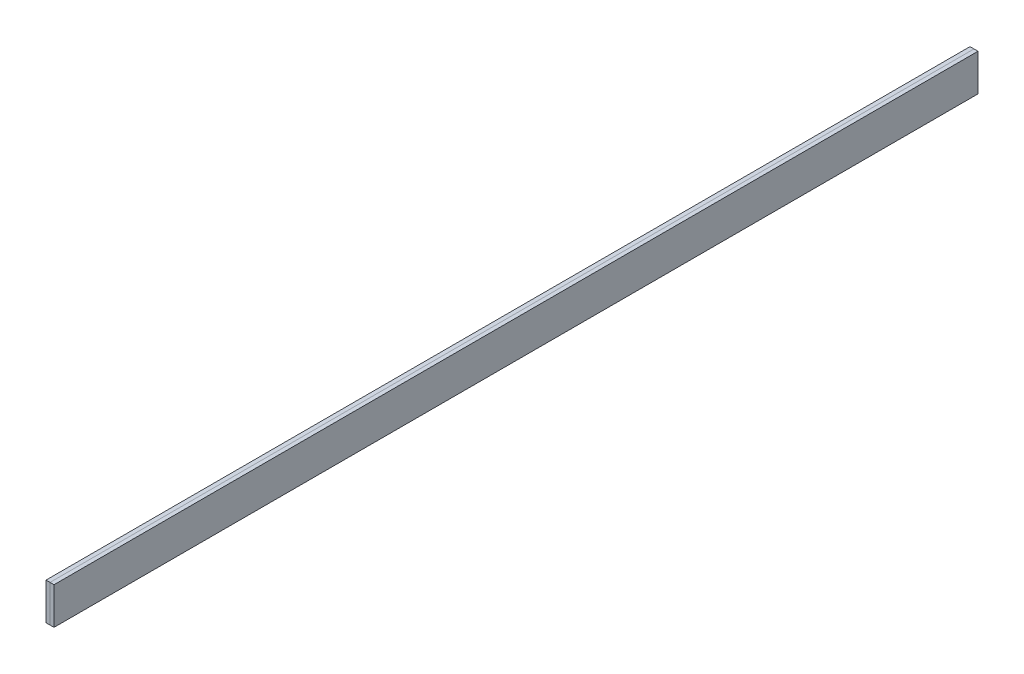
ISO-10303-21;
HEADER;
FILE_DESCRIPTION(('STEP AP214'),'2;1');
FILE_NAME('part.step','',(''),(''),'','','');
FILE_SCHEMA(('AUTOMOTIVE_DESIGN { 1 0 10303 214 1 1 1 1 }'));
ENDSEC;
DATA;
#1=APPLICATION_CONTEXT('core data for automotive mechanical design processes');
#2=APPLICATION_PROTOCOL_DEFINITION('international standard','automotive_design',2000,#1);
#3=PRODUCT_CONTEXT('',#1,'mechanical');
#4=PRODUCT('Part','Part','',(#3));
#5=PRODUCT_RELATED_PRODUCT_CATEGORY('part','',(#4));
#6=PRODUCT_DEFINITION_FORMATION('','',#4);
#7=PRODUCT_DEFINITION_CONTEXT('part definition',#1,'design');
#8=PRODUCT_DEFINITION('design','',#6,#7);
#9=PRODUCT_DEFINITION_SHAPE('','',#8);
#10=(LENGTH_UNIT() NAMED_UNIT(*) SI_UNIT(.MILLI.,.METRE.));
#11=(NAMED_UNIT(*) PLANE_ANGLE_UNIT() SI_UNIT($,.RADIAN.));
#12=(NAMED_UNIT(*) SI_UNIT($,.STERADIAN.) SOLID_ANGLE_UNIT());
#13=UNCERTAINTY_MEASURE_WITH_UNIT(LENGTH_MEASURE(1.E-05),#10,'distance_accuracy_value','');
#14=(GEOMETRIC_REPRESENTATION_CONTEXT(3) GLOBAL_UNCERTAINTY_ASSIGNED_CONTEXT((#13)) GLOBAL_UNIT_ASSIGNED_CONTEXT((#10,
#11,#12)) REPRESENTATION_CONTEXT('',''));
#15=CARTESIAN_POINT('',(0.,0.,0.));
#16=DIRECTION('',(0.,0.,1.));
#17=DIRECTION('',(1.,0.,0.));
#18=AXIS2_PLACEMENT_3D('',#15,#16,#17);
#19=CARTESIAN_POINT('',(0.,0.,150.));
#20=DIRECTION('',(1.,0.,0.));
#21=DIRECTION('',(0.,0.,1.));
#22=AXIS2_PLACEMENT_3D('',#19,#20,#21);
#23=PLANE('',#22);
#24=DIRECTION('',(0.,1.,0.));
#25=VECTOR('',#24,1.);
#26=CARTESIAN_POINT('',(0.,0.,0.));
#27=LINE('',#26,#25);
#28=CARTESIAN_POINT('',(0.,0.,0.));
#29=VERTEX_POINT('',#28);
#30=CARTESIAN_POINT('',(0.,6.,0.));
#31=VERTEX_POINT('',#30);
#32=EDGE_CURVE('E132',#29,#31,#27,.T.);
#33=ORIENTED_EDGE('',*,*,#32,.F.);
#34=DIRECTION('',(0.,0.,-1.));
#35=VECTOR('',#34,1.);
#36=CARTESIAN_POINT('',(0.,0.,150.));
#37=LINE('',#36,#35);
#38=CARTESIAN_POINT('',(0.,0.,150.));
#39=VERTEX_POINT('',#38);
#40=EDGE_CURVE('E131',#39,#29,#37,.T.);
#41=ORIENTED_EDGE('',*,*,#40,.F.);
#42=DIRECTION('',(0.,1.,0.));
#43=VECTOR('',#42,1.);
#44=CARTESIAN_POINT('',(0.,0.,150.));
#45=LINE('',#44,#43);
#46=CARTESIAN_POINT('',(0.,6.,150.));
#47=VERTEX_POINT('',#46);
#48=EDGE_CURVE('E124',#39,#47,#45,.T.);
#49=ORIENTED_EDGE('',*,*,#48,.T.);
#50=DIRECTION('',(0.,0.,-1.));
#51=VECTOR('',#50,1.);
#52=CARTESIAN_POINT('',(0.,6.,150.));
#53=LINE('',#52,#51);
#54=EDGE_CURVE('E12',#47,#31,#53,.T.);
#55=ORIENTED_EDGE('',*,*,#54,.T.);
#56=EDGE_LOOP('',(#33,#41,#49,#55));
#57=FACE_BOUND('',#56,.T.);
#58=ADVANCED_FACE('F55',(#57),#23,.F.);
#59=CARTESIAN_POINT('',(0.,6.,150.));
#60=DIRECTION('',(0.,-1.,0.));
#61=DIRECTION('',(0.,0.,-1.));
#62=AXIS2_PLACEMENT_3D('',#59,#60,#61);
#63=PLANE('',#62);
#64=DIRECTION('',(1.,0.,0.));
#65=VECTOR('',#64,1.);
#66=CARTESIAN_POINT('',(0.,6.,0.));
#67=LINE('',#66,#65);
#68=CARTESIAN_POINT('',(0.650000000000001,6.,0.));
#69=VERTEX_POINT('',#68);
#70=EDGE_CURVE('E135',#31,#69,#67,.T.);
#71=ORIENTED_EDGE('',*,*,#70,.F.);
#72=ORIENTED_EDGE('',*,*,#54,.F.);
#73=DIRECTION('',(1.,0.,0.));
#74=VECTOR('',#73,1.);
#75=CARTESIAN_POINT('',(0.,6.,150.));
#76=LINE('',#75,#74);
#77=CARTESIAN_POINT('',(0.650000000000001,6.,150.));
#78=VERTEX_POINT('',#77);
#79=EDGE_CURVE('E104',#47,#78,#76,.T.);
#80=ORIENTED_EDGE('',*,*,#79,.T.);
#81=DIRECTION('',(0.,0.,-1.));
#82=VECTOR('',#81,1.);
#83=CARTESIAN_POINT('',(0.650000000000001,6.,150.));
#84=LINE('',#83,#82);
#85=EDGE_CURVE('E64',#78,#69,#84,.T.);
#86=ORIENTED_EDGE('',*,*,#85,.T.);
#87=EDGE_LOOP('',(#71,#72,#80,#86));
#88=FACE_BOUND('',#87,.T.);
#89=ADVANCED_FACE('F121',(#88),#63,.F.);
#90=CARTESIAN_POINT('',(0.65,0.,150.));
#91=DIRECTION('',(-1.,0.,0.));
#92=DIRECTION('',(0.,1.,0.));
#93=AXIS2_PLACEMENT_3D('',#90,#91,#92);
#94=PLANE('',#93);
#95=DIRECTION('',(0.,-1.,0.));
#96=VECTOR('',#95,1.);
#97=CARTESIAN_POINT('',(0.65,0.,0.));
#98=LINE('',#97,#96);
#99=CARTESIAN_POINT('',(0.65,0.,0.));
#100=VERTEX_POINT('',#99);
#101=EDGE_CURVE('E116',#69,#100,#98,.T.);
#102=ORIENTED_EDGE('',*,*,#101,.F.);
#103=ORIENTED_EDGE('',*,*,#85,.F.);
#104=DIRECTION('',(0.,-1.,0.));
#105=VECTOR('',#104,1.);
#106=CARTESIAN_POINT('',(0.65,0.,150.));
#107=LINE('',#106,#105);
#108=CARTESIAN_POINT('',(0.65,0.,150.));
#109=VERTEX_POINT('',#108);
#110=EDGE_CURVE('E108',#78,#109,#107,.T.);
#111=ORIENTED_EDGE('',*,*,#110,.T.);
#112=DIRECTION('',(0.,0.,-1.));
#113=VECTOR('',#112,1.);
#114=CARTESIAN_POINT('',(0.65,0.,150.));
#115=LINE('',#114,#113);
#116=EDGE_CURVE('E120',#109,#100,#115,.T.);
#117=ORIENTED_EDGE('',*,*,#116,.T.);
#118=EDGE_LOOP('',(#102,#103,#111,#117));
#119=FACE_BOUND('',#118,.T.);
#120=ADVANCED_FACE('F115',(#119),#94,.F.);
#121=CARTESIAN_POINT('',(0.,0.,150.));
#122=DIRECTION('',(0.,1.,0.));
#123=DIRECTION('',(0.,0.,1.));
#124=AXIS2_PLACEMENT_3D('',#121,#122,#123);
#125=PLANE('',#124);
#126=DIRECTION('',(-1.,0.,0.));
#127=VECTOR('',#126,1.);
#128=CARTESIAN_POINT('',(0.,0.,0.));
#129=LINE('',#128,#127);
#130=EDGE_CURVE('E93',#100,#29,#129,.T.);
#131=ORIENTED_EDGE('',*,*,#130,.F.);
#132=ORIENTED_EDGE('',*,*,#116,.F.);
#133=DIRECTION('',(-1.,0.,0.));
#134=VECTOR('',#133,1.);
#135=CARTESIAN_POINT('',(0.,0.,150.));
#136=LINE('',#135,#134);
#137=EDGE_CURVE('E75',#109,#39,#136,.T.);
#138=ORIENTED_EDGE('',*,*,#137,.T.);
#139=ORIENTED_EDGE('',*,*,#40,.T.);
#140=EDGE_LOOP('',(#131,#132,#138,#139));
#141=FACE_BOUND('',#140,.T.);
#142=ADVANCED_FACE('F149',(#141),#125,.F.);
#143=CARTESIAN_POINT('',(0.,0.,150.));
#144=DIRECTION('',(0.,0.,1.));
#145=DIRECTION('',(-1.,0.,0.));
#146=AXIS2_PLACEMENT_3D('',#143,#144,#145);
#147=PLANE('',#146);
#148=ORIENTED_EDGE('',*,*,#48,.F.);
#149=ORIENTED_EDGE('',*,*,#137,.F.);
#150=ORIENTED_EDGE('',*,*,#110,.F.);
#151=ORIENTED_EDGE('',*,*,#79,.F.);
#152=EDGE_LOOP('',(#148,#149,#150,#151));
#153=FACE_BOUND('',#152,.T.);
#154=ADVANCED_FACE('F110',(#153),#147,.T.);
#155=CARTESIAN_POINT('',(0.,0.,0.));
#156=DIRECTION('',(0.,0.,1.));
#157=DIRECTION('',(-1.,0.,0.));
#158=AXIS2_PLACEMENT_3D('',#155,#156,#157);
#159=PLANE('',#158);
#160=ORIENTED_EDGE('',*,*,#32,.T.);
#161=ORIENTED_EDGE('',*,*,#70,.T.);
#162=ORIENTED_EDGE('',*,*,#101,.T.);
#163=ORIENTED_EDGE('',*,*,#130,.T.);
#164=EDGE_LOOP('',(#160,#161,#162,#163));
#165=FACE_BOUND('',#164,.T.);
#166=ADVANCED_FACE('F145',(#165),#159,.F.);
#167=CLOSED_SHELL('',(#58,#89,#120,#142,#154,#166));
#168=MANIFOLD_SOLID_BREP('B2',#167);
#169=CARTESIAN_POINT('',(0.,0.,150.));
#170=DIRECTION('',(-1.,0.,0.));
#171=DIRECTION('',(0.,0.,1.));
#172=AXIS2_PLACEMENT_3D('',#169,#170,#171);
#173=PLANE('',#172);
#174=DIRECTION('',(0.,1.,0.));
#175=VECTOR('',#174,1.);
#176=CARTESIAN_POINT('',(0.,0.,0.));
#177=LINE('',#176,#175);
#178=CARTESIAN_POINT('',(0.,0.,0.));
#179=VERTEX_POINT('',#178);
#180=CARTESIAN_POINT('',(0.,6.,0.));
#181=VERTEX_POINT('',#180);
#182=EDGE_CURVE('E308',#179,#181,#177,.T.);
#183=ORIENTED_EDGE('',*,*,#182,.T.);
#184=DIRECTION('',(0.,0.,-1.));
#185=VECTOR('',#184,1.);
#186=CARTESIAN_POINT('',(0.,6.,150.));
#187=LINE('',#186,#185);
#188=CARTESIAN_POINT('',(0.,6.,150.));
#189=VERTEX_POINT('',#188);
#190=EDGE_CURVE('E53',#189,#181,#187,.T.);
#191=ORIENTED_EDGE('',*,*,#190,.F.);
#192=DIRECTION('',(0.,1.,0.));
#193=VECTOR('',#192,1.);
#194=CARTESIAN_POINT('',(0.,0.,150.));
#195=LINE('',#194,#193);
#196=CARTESIAN_POINT('',(0.,0.,150.));
#197=VERTEX_POINT('',#196);
#198=EDGE_CURVE('E290',#197,#189,#195,.T.);
#199=ORIENTED_EDGE('',*,*,#198,.F.);
#200=DIRECTION('',(0.,0.,-1.));
#201=VECTOR('',#200,1.);
#202=CARTESIAN_POINT('',(0.,0.,150.));
#203=LINE('',#202,#201);
#204=EDGE_CURVE('E304',#197,#179,#203,.T.);
#205=ORIENTED_EDGE('',*,*,#204,.T.);
#206=EDGE_LOOP('',(#183,#191,#199,#205));
#207=FACE_BOUND('',#206,.T.);
#208=ADVANCED_FACE('F230',(#207),#173,.F.);
#209=CARTESIAN_POINT('',(0.,6.,150.));
#210=DIRECTION('',(0.,-1.,0.));
#211=DIRECTION('',(0.,0.,-1.));
#212=AXIS2_PLACEMENT_3D('',#209,#210,#211);
#213=PLANE('',#212);
#214=DIRECTION('',(-1.,0.,0.));
#215=VECTOR('',#214,1.);
#216=CARTESIAN_POINT('',(0.,6.,0.));
#217=LINE('',#216,#215);
#218=CARTESIAN_POINT('',(-0.650000000000001,6.,0.));
#219=VERTEX_POINT('',#218);
#220=EDGE_CURVE('E295',#181,#219,#217,.T.);
#221=ORIENTED_EDGE('',*,*,#220,.T.);
#222=DIRECTION('',(0.,0.,-1.));
#223=VECTOR('',#222,1.);
#224=CARTESIAN_POINT('',(-0.650000000000001,6.,150.));
#225=LINE('',#224,#223);
#226=CARTESIAN_POINT('',(-0.650000000000001,6.,150.));
#227=VERTEX_POINT('',#226);
#228=EDGE_CURVE('E239',#227,#219,#225,.T.);
#229=ORIENTED_EDGE('',*,*,#228,.F.);
#230=DIRECTION('',(-1.,0.,0.));
#231=VECTOR('',#230,1.);
#232=CARTESIAN_POINT('',(0.,6.,150.));
#233=LINE('',#232,#231);
#234=EDGE_CURVE('E285',#189,#227,#233,.T.);
#235=ORIENTED_EDGE('',*,*,#234,.F.);
#236=ORIENTED_EDGE('',*,*,#190,.T.);
#237=EDGE_LOOP('',(#221,#229,#235,#236));
#238=FACE_BOUND('',#237,.T.);
#239=ADVANCED_FACE('F294',(#238),#213,.F.);
#240=CARTESIAN_POINT('',(-0.65,0.,150.));
#241=DIRECTION('',(1.,0.,0.));
#242=DIRECTION('',(0.,1.,0.));
#243=AXIS2_PLACEMENT_3D('',#240,#241,#242);
#244=PLANE('',#243);
#245=DIRECTION('',(0.,-1.,0.));
#246=VECTOR('',#245,1.);
#247=CARTESIAN_POINT('',(-0.65,0.,0.));
#248=LINE('',#247,#246);
#249=CARTESIAN_POINT('',(-0.65,0.,0.));
#250=VERTEX_POINT('',#249);
#251=EDGE_CURVE('E270',#219,#250,#248,.T.);
#252=ORIENTED_EDGE('',*,*,#251,.T.);
#253=DIRECTION('',(0.,0.,-1.));
#254=VECTOR('',#253,1.);
#255=CARTESIAN_POINT('',(-0.65,0.,150.));
#256=LINE('',#255,#254);
#257=CARTESIAN_POINT('',(-0.65,0.,150.));
#258=VERTEX_POINT('',#257);
#259=EDGE_CURVE('E297',#258,#250,#256,.T.);
#260=ORIENTED_EDGE('',*,*,#259,.F.);
#261=DIRECTION('',(0.,-1.,0.));
#262=VECTOR('',#261,1.);
#263=CARTESIAN_POINT('',(-0.65,0.,150.));
#264=LINE('',#263,#262);
#265=EDGE_CURVE('E288',#227,#258,#264,.T.);
#266=ORIENTED_EDGE('',*,*,#265,.F.);
#267=ORIENTED_EDGE('',*,*,#228,.T.);
#268=EDGE_LOOP('',(#252,#260,#266,#267));
#269=FACE_BOUND('',#268,.T.);
#270=ADVANCED_FACE('F298',(#269),#244,.F.);
#271=CARTESIAN_POINT('',(0.,0.,150.));
#272=DIRECTION('',(0.,1.,0.));
#273=DIRECTION('',(0.,0.,1.));
#274=AXIS2_PLACEMENT_3D('',#271,#272,#273);
#275=PLANE('',#274);
#276=DIRECTION('',(1.,0.,0.));
#277=VECTOR('',#276,1.);
#278=CARTESIAN_POINT('',(0.,0.,0.));
#279=LINE('',#278,#277);
#280=EDGE_CURVE('E277',#250,#179,#279,.T.);
#281=ORIENTED_EDGE('',*,*,#280,.T.);
#282=ORIENTED_EDGE('',*,*,#204,.F.);
#283=DIRECTION('',(1.,0.,0.));
#284=VECTOR('',#283,1.);
#285=CARTESIAN_POINT('',(0.,0.,150.));
#286=LINE('',#285,#284);
#287=EDGE_CURVE('E249',#258,#197,#286,.T.);
#288=ORIENTED_EDGE('',*,*,#287,.F.);
#289=ORIENTED_EDGE('',*,*,#259,.T.);
#290=EDGE_LOOP('',(#281,#282,#288,#289));
#291=FACE_BOUND('',#290,.T.);
#292=ADVANCED_FACE('F319',(#291),#275,.F.);
#293=CARTESIAN_POINT('',(0.,0.,150.));
#294=DIRECTION('',(0.,0.,1.));
#295=DIRECTION('',(1.,0.,0.));
#296=AXIS2_PLACEMENT_3D('',#293,#294,#295);
#297=PLANE('',#296);
#298=ORIENTED_EDGE('',*,*,#198,.T.);
#299=ORIENTED_EDGE('',*,*,#234,.T.);
#300=ORIENTED_EDGE('',*,*,#265,.T.);
#301=ORIENTED_EDGE('',*,*,#287,.T.);
#302=EDGE_LOOP('',(#298,#299,#300,#301));
#303=FACE_BOUND('',#302,.T.);
#304=ADVANCED_FACE('F286',(#303),#297,.T.);
#305=CARTESIAN_POINT('',(0.,0.,0.));
#306=DIRECTION('',(0.,0.,1.));
#307=DIRECTION('',(1.,0.,0.));
#308=AXIS2_PLACEMENT_3D('',#305,#306,#307);
#309=PLANE('',#308);
#310=ORIENTED_EDGE('',*,*,#182,.F.);
#311=ORIENTED_EDGE('',*,*,#280,.F.);
#312=ORIENTED_EDGE('',*,*,#251,.F.);
#313=ORIENTED_EDGE('',*,*,#220,.F.);
#314=EDGE_LOOP('',(#310,#311,#312,#313));
#315=FACE_BOUND('',#314,.T.);
#316=ADVANCED_FACE('F322',(#315),#309,.F.);
#317=CLOSED_SHELL('',(#208,#239,#270,#292,#304,#316));
#318=MANIFOLD_SOLID_BREP('B6',#317);
#319=ADVANCED_BREP_SHAPE_REPRESENTATION('',(#18,#168,#318),#14);
#320=SHAPE_DEFINITION_REPRESENTATION(#9,#319);
ENDSEC;
END-ISO-10303-21;
